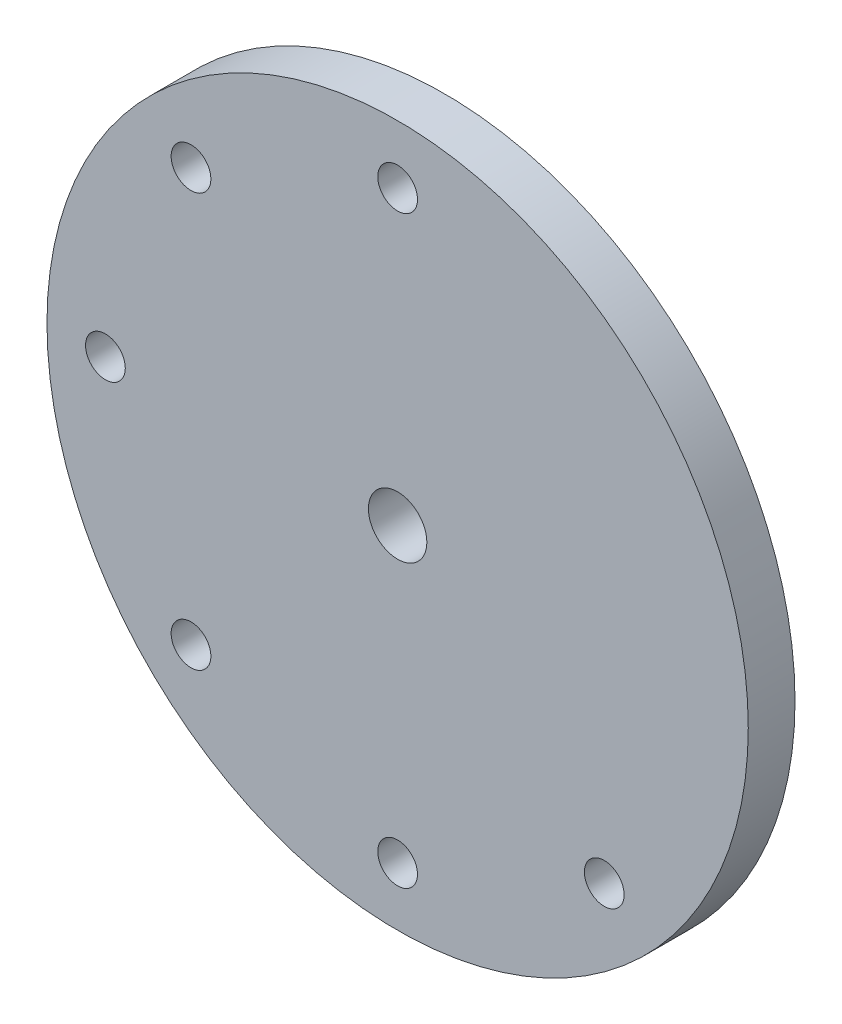
ISO-10303-21;
HEADER;
FILE_DESCRIPTION(('STEP AP214'),'2;1');
FILE_NAME('part.step','',(''),(''),'','','');
FILE_SCHEMA(('AUTOMOTIVE_DESIGN { 1 0 10303 214 1 1 1 1 }'));
ENDSEC;
DATA;
#1=APPLICATION_CONTEXT('core data for automotive mechanical design processes');
#2=APPLICATION_PROTOCOL_DEFINITION('international standard','automotive_design',2000,#1);
#3=PRODUCT_CONTEXT('',#1,'mechanical');
#4=PRODUCT('Part','Part','',(#3));
#5=PRODUCT_RELATED_PRODUCT_CATEGORY('part','',(#4));
#6=PRODUCT_DEFINITION_FORMATION('','',#4);
#7=PRODUCT_DEFINITION_CONTEXT('part definition',#1,'design');
#8=PRODUCT_DEFINITION('design','',#6,#7);
#9=PRODUCT_DEFINITION_SHAPE('','',#8);
#10=(LENGTH_UNIT() NAMED_UNIT(*) SI_UNIT(.MILLI.,.METRE.));
#11=(NAMED_UNIT(*) PLANE_ANGLE_UNIT() SI_UNIT($,.RADIAN.));
#12=(NAMED_UNIT(*) SI_UNIT($,.STERADIAN.) SOLID_ANGLE_UNIT());
#13=UNCERTAINTY_MEASURE_WITH_UNIT(LENGTH_MEASURE(1.E-05),#10,'distance_accuracy_value','');
#14=(GEOMETRIC_REPRESENTATION_CONTEXT(3) GLOBAL_UNCERTAINTY_ASSIGNED_CONTEXT((#13)) GLOBAL_UNIT_ASSIGNED_CONTEXT((#10,
#11,#12)) REPRESENTATION_CONTEXT('',''));
#15=CARTESIAN_POINT('',(0.,0.,0.));
#16=DIRECTION('',(0.,0.,1.));
#17=DIRECTION('',(1.,0.,0.));
#18=AXIS2_PLACEMENT_3D('',#15,#16,#17);
#19=CARTESIAN_POINT('',(0.,0.,20.));
#20=DIRECTION('',(0.,0.,1.));
#21=DIRECTION('',(1.,0.,0.));
#22=AXIS2_PLACEMENT_3D('',#19,#20,#21);
#23=PLANE('',#22);
#24=CARTESIAN_POINT('',(88.3883476483187,-88.3883476483183,20.));
#25=DIRECTION('',(0.,0.,1.));
#26=DIRECTION('',(1.,0.,0.));
#27=AXIS2_PLACEMENT_3D('',#24,#25,#26);
#28=CIRCLE('',#27,8.49999999999994);
#29=CARTESIAN_POINT('',(96.8883476483186,-88.3883476483183,20.));
#30=VERTEX_POINT('',#29);
#31=EDGE_CURVE('E78',#30,#30,#28,.T.);
#32=ORIENTED_EDGE('',*,*,#31,.F.);
#33=EDGE_LOOP('',(#32));
#34=FACE_BOUND('',#33,.T.);
#35=CARTESIAN_POINT('',(-88.3883476483187,88.3883476483182,20.));
#36=DIRECTION('',(0.,0.,1.));
#37=DIRECTION('',(1.,0.,0.));
#38=AXIS2_PLACEMENT_3D('',#35,#36,#37);
#39=CIRCLE('',#38,8.50000000000001);
#40=CARTESIAN_POINT('',(-79.8883476483186,88.3883476483182,20.));
#41=VERTEX_POINT('',#40);
#42=EDGE_CURVE('E66',#41,#41,#39,.T.);
#43=ORIENTED_EDGE('',*,*,#42,.F.);
#44=EDGE_LOOP('',(#43));
#45=FACE_BOUND('',#44,.T.);
#46=CARTESIAN_POINT('',(-88.3883476483179,-88.3883476483189,20.));
#47=DIRECTION('',(0.,0.,1.));
#48=DIRECTION('',(1.,0.,0.));
#49=AXIS2_PLACEMENT_3D('',#46,#47,#48);
#50=CIRCLE('',#49,8.50000000000001);
#51=CARTESIAN_POINT('',(-79.8883476483179,-88.3883476483189,20.));
#52=VERTEX_POINT('',#51);
#53=EDGE_CURVE('E54',#52,#52,#50,.T.);
#54=ORIENTED_EDGE('',*,*,#53,.F.);
#55=EDGE_LOOP('',(#54));
#56=FACE_BOUND('',#55,.T.);
#57=CARTESIAN_POINT('',(0.,0.,20.));
#58=DIRECTION('',(0.,0.,1.));
#59=DIRECTION('',(1.,0.,0.));
#60=AXIS2_PLACEMENT_3D('',#57,#58,#59);
#61=CIRCLE('',#60,12.5);
#62=CARTESIAN_POINT('',(12.5,0.,20.));
#63=VERTEX_POINT('',#62);
#64=EDGE_CURVE('E43',#63,#63,#61,.T.);
#65=ORIENTED_EDGE('',*,*,#64,.F.);
#66=EDGE_LOOP('',(#65));
#67=FACE_BOUND('',#66,.T.);
#68=CARTESIAN_POINT('',(0.,0.,20.));
#69=DIRECTION('',(0.,0.,1.));
#70=DIRECTION('',(1.,0.,0.));
#71=AXIS2_PLACEMENT_3D('',#68,#69,#70);
#72=CIRCLE('',#71,150.);
#73=CARTESIAN_POINT('',(150.,0.,20.));
#74=VERTEX_POINT('',#73);
#75=EDGE_CURVE('E10',#74,#74,#72,.T.);
#76=ORIENTED_EDGE('',*,*,#75,.T.);
#77=EDGE_LOOP('',(#76));
#78=FACE_BOUND('',#77,.T.);
#79=CARTESIAN_POINT('',(-125.,-4.9960036108132E-13,20.));
#80=DIRECTION('',(0.,0.,1.));
#81=DIRECTION('',(1.,0.,0.));
#82=AXIS2_PLACEMENT_3D('',#79,#80,#81);
#83=CIRCLE('',#82,8.50000000000005);
#84=CARTESIAN_POINT('',(-116.5,-4.9960036108132E-13,20.));
#85=VERTEX_POINT('',#84);
#86=EDGE_CURVE('E48',#85,#85,#83,.T.);
#87=ORIENTED_EDGE('',*,*,#86,.F.);
#88=EDGE_LOOP('',(#87));
#89=FACE_BOUND('',#88,.T.);
#90=CARTESIAN_POINT('',(0.,-125.,20.));
#91=DIRECTION('',(0.,0.,1.));
#92=DIRECTION('',(1.,0.,0.));
#93=AXIS2_PLACEMENT_3D('',#90,#91,#92);
#94=CIRCLE('',#93,8.5);
#95=CARTESIAN_POINT('',(8.50000000000004,-125.,20.));
#96=VERTEX_POINT('',#95);
#97=EDGE_CURVE('E60',#96,#96,#94,.T.);
#98=ORIENTED_EDGE('',*,*,#97,.F.);
#99=EDGE_LOOP('',(#98));
#100=FACE_BOUND('',#99,.T.);
#101=CARTESIAN_POINT('',(0.,125.,20.));
#102=DIRECTION('',(0.,0.,1.));
#103=DIRECTION('',(1.,0.,0.));
#104=AXIS2_PLACEMENT_3D('',#101,#102,#103);
#105=CIRCLE('',#104,8.5);
#106=CARTESIAN_POINT('',(8.50000000000001,125.,20.));
#107=VERTEX_POINT('',#106);
#108=EDGE_CURVE('E72',#107,#107,#105,.T.);
#109=ORIENTED_EDGE('',*,*,#108,.F.);
#110=EDGE_LOOP('',(#109));
#111=FACE_BOUND('',#110,.T.);
#112=ADVANCED_FACE('F32',(#34,#45,#56,#67,#78,#89,#100,#111),#23,.T.);
#113=CARTESIAN_POINT('',(0.,0.,0.));
#114=DIRECTION('',(0.,0.,1.));
#115=DIRECTION('',(1.,0.,0.));
#116=AXIS2_PLACEMENT_3D('',#113,#114,#115);
#117=PLANE('',#116);
#118=CARTESIAN_POINT('',(0.,0.,0.));
#119=DIRECTION('',(0.,0.,1.));
#120=DIRECTION('',(1.,0.,0.));
#121=AXIS2_PLACEMENT_3D('',#118,#119,#120);
#122=CIRCLE('',#121,150.);
#123=CARTESIAN_POINT('',(150.,0.,0.));
#124=VERTEX_POINT('',#123);
#125=EDGE_CURVE('E36',#124,#124,#122,.T.);
#126=ORIENTED_EDGE('',*,*,#125,.F.);
#127=EDGE_LOOP('',(#126));
#128=FACE_BOUND('',#127,.T.);
#129=CARTESIAN_POINT('',(0.,0.,0.));
#130=DIRECTION('',(0.,0.,1.));
#131=DIRECTION('',(1.,0.,0.));
#132=AXIS2_PLACEMENT_3D('',#129,#130,#131);
#133=CIRCLE('',#132,12.5);
#134=CARTESIAN_POINT('',(12.5,0.,0.));
#135=VERTEX_POINT('',#134);
#136=EDGE_CURVE('E45',#135,#135,#133,.T.);
#137=ORIENTED_EDGE('',*,*,#136,.T.);
#138=EDGE_LOOP('',(#137));
#139=FACE_BOUND('',#138,.T.);
#140=CARTESIAN_POINT('',(-125.,-4.9960036108132E-13,0.));
#141=DIRECTION('',(0.,0.,1.));
#142=DIRECTION('',(1.,0.,0.));
#143=AXIS2_PLACEMENT_3D('',#140,#141,#142);
#144=CIRCLE('',#143,8.50000000000005);
#145=CARTESIAN_POINT('',(-116.5,-4.9960036108132E-13,0.));
#146=VERTEX_POINT('',#145);
#147=EDGE_CURVE('E51',#146,#146,#144,.T.);
#148=ORIENTED_EDGE('',*,*,#147,.T.);
#149=EDGE_LOOP('',(#148));
#150=FACE_BOUND('',#149,.T.);
#151=CARTESIAN_POINT('',(-88.3883476483179,-88.3883476483189,0.));
#152=DIRECTION('',(0.,0.,1.));
#153=DIRECTION('',(1.,0.,0.));
#154=AXIS2_PLACEMENT_3D('',#151,#152,#153);
#155=CIRCLE('',#154,8.50000000000001);
#156=CARTESIAN_POINT('',(-79.8883476483179,-88.3883476483189,0.));
#157=VERTEX_POINT('',#156);
#158=EDGE_CURVE('E57',#157,#157,#155,.T.);
#159=ORIENTED_EDGE('',*,*,#158,.T.);
#160=EDGE_LOOP('',(#159));
#161=FACE_BOUND('',#160,.T.);
#162=CARTESIAN_POINT('',(0.,-125.,0.));
#163=DIRECTION('',(0.,0.,1.));
#164=DIRECTION('',(1.,0.,0.));
#165=AXIS2_PLACEMENT_3D('',#162,#163,#164);
#166=CIRCLE('',#165,8.5);
#167=CARTESIAN_POINT('',(8.50000000000004,-125.,0.));
#168=VERTEX_POINT('',#167);
#169=EDGE_CURVE('E63',#168,#168,#166,.T.);
#170=ORIENTED_EDGE('',*,*,#169,.T.);
#171=EDGE_LOOP('',(#170));
#172=FACE_BOUND('',#171,.T.);
#173=CARTESIAN_POINT('',(-88.3883476483187,88.3883476483182,0.));
#174=DIRECTION('',(0.,0.,1.));
#175=DIRECTION('',(1.,0.,0.));
#176=AXIS2_PLACEMENT_3D('',#173,#174,#175);
#177=CIRCLE('',#176,8.50000000000001);
#178=CARTESIAN_POINT('',(-79.8883476483186,88.3883476483182,0.));
#179=VERTEX_POINT('',#178);
#180=EDGE_CURVE('E69',#179,#179,#177,.T.);
#181=ORIENTED_EDGE('',*,*,#180,.T.);
#182=EDGE_LOOP('',(#181));
#183=FACE_BOUND('',#182,.T.);
#184=CARTESIAN_POINT('',(0.,125.,0.));
#185=DIRECTION('',(0.,0.,1.));
#186=DIRECTION('',(1.,0.,0.));
#187=AXIS2_PLACEMENT_3D('',#184,#185,#186);
#188=CIRCLE('',#187,8.5);
#189=CARTESIAN_POINT('',(8.50000000000001,125.,0.));
#190=VERTEX_POINT('',#189);
#191=EDGE_CURVE('E75',#190,#190,#188,.T.);
#192=ORIENTED_EDGE('',*,*,#191,.T.);
#193=EDGE_LOOP('',(#192));
#194=FACE_BOUND('',#193,.T.);
#195=CARTESIAN_POINT('',(88.3883476483187,-88.3883476483183,0.));
#196=DIRECTION('',(0.,0.,1.));
#197=DIRECTION('',(1.,0.,0.));
#198=AXIS2_PLACEMENT_3D('',#195,#196,#197);
#199=CIRCLE('',#198,8.49999999999994);
#200=CARTESIAN_POINT('',(96.8883476483186,-88.3883476483183,0.));
#201=VERTEX_POINT('',#200);
#202=EDGE_CURVE('E81',#201,#201,#199,.T.);
#203=ORIENTED_EDGE('',*,*,#202,.T.);
#204=EDGE_LOOP('',(#203));
#205=FACE_BOUND('',#204,.T.);
#206=ADVANCED_FACE('F92',(#128,#139,#150,#161,#172,#183,#194,#205),#117,.F.);
#207=CARTESIAN_POINT('',(0.,0.,20.));
#208=DIRECTION('',(0.,0.,-1.));
#209=DIRECTION('',(-1.,0.,0.));
#210=AXIS2_PLACEMENT_3D('',#207,#208,#209);
#211=CYLINDRICAL_SURFACE('',#210,150.);
#212=ORIENTED_EDGE('',*,*,#75,.F.);
#213=EDGE_LOOP('',(#212));
#214=FACE_BOUND('',#213,.T.);
#215=ORIENTED_EDGE('',*,*,#125,.T.);
#216=EDGE_LOOP('',(#215));
#217=FACE_BOUND('',#216,.T.);
#218=ADVANCED_FACE('F34',(#214,#217),#211,.T.);
#219=CARTESIAN_POINT('',(0.,0.,20.));
#220=DIRECTION('',(0.,0.,-1.));
#221=DIRECTION('',(-1.,0.,0.));
#222=AXIS2_PLACEMENT_3D('',#219,#220,#221);
#223=CYLINDRICAL_SURFACE('',#222,12.5);
#224=ORIENTED_EDGE('',*,*,#64,.T.);
#225=EDGE_LOOP('',(#224));
#226=FACE_BOUND('',#225,.T.);
#227=ORIENTED_EDGE('',*,*,#136,.F.);
#228=EDGE_LOOP('',(#227));
#229=FACE_BOUND('',#228,.T.);
#230=ADVANCED_FACE('F136',(#226,#229),#223,.F.);
#231=CARTESIAN_POINT('',(-125.,-4.9960036108132E-13,20.));
#232=DIRECTION('',(0.,0.,-1.));
#233=DIRECTION('',(-1.,0.,0.));
#234=AXIS2_PLACEMENT_3D('',#231,#232,#233);
#235=CYLINDRICAL_SURFACE('',#234,8.50000000000005);
#236=ORIENTED_EDGE('',*,*,#86,.T.);
#237=EDGE_LOOP('',(#236));
#238=FACE_BOUND('',#237,.T.);
#239=ORIENTED_EDGE('',*,*,#147,.F.);
#240=EDGE_LOOP('',(#239));
#241=FACE_BOUND('',#240,.T.);
#242=ADVANCED_FACE('F132',(#238,#241),#235,.F.);
#243=CARTESIAN_POINT('',(-88.3883476483179,-88.3883476483189,20.));
#244=DIRECTION('',(0.,0.,-1.));
#245=DIRECTION('',(-1.,0.,0.));
#246=AXIS2_PLACEMENT_3D('',#243,#244,#245);
#247=CYLINDRICAL_SURFACE('',#246,8.50000000000001);
#248=ORIENTED_EDGE('',*,*,#53,.T.);
#249=EDGE_LOOP('',(#248));
#250=FACE_BOUND('',#249,.T.);
#251=ORIENTED_EDGE('',*,*,#158,.F.);
#252=EDGE_LOOP('',(#251));
#253=FACE_BOUND('',#252,.T.);
#254=ADVANCED_FACE('F128',(#250,#253),#247,.F.);
#255=CARTESIAN_POINT('',(0.,-125.,20.));
#256=DIRECTION('',(0.,0.,-1.));
#257=DIRECTION('',(-1.,0.,0.));
#258=AXIS2_PLACEMENT_3D('',#255,#256,#257);
#259=CYLINDRICAL_SURFACE('',#258,8.5);
#260=ORIENTED_EDGE('',*,*,#97,.T.);
#261=EDGE_LOOP('',(#260));
#262=FACE_BOUND('',#261,.T.);
#263=ORIENTED_EDGE('',*,*,#169,.F.);
#264=EDGE_LOOP('',(#263));
#265=FACE_BOUND('',#264,.T.);
#266=ADVANCED_FACE('F124',(#262,#265),#259,.F.);
#267=CARTESIAN_POINT('',(-88.3883476483187,88.3883476483182,20.));
#268=DIRECTION('',(0.,0.,-1.));
#269=DIRECTION('',(-1.,0.,0.));
#270=AXIS2_PLACEMENT_3D('',#267,#268,#269);
#271=CYLINDRICAL_SURFACE('',#270,8.50000000000001);
#272=ORIENTED_EDGE('',*,*,#42,.T.);
#273=EDGE_LOOP('',(#272));
#274=FACE_BOUND('',#273,.T.);
#275=ORIENTED_EDGE('',*,*,#180,.F.);
#276=EDGE_LOOP('',(#275));
#277=FACE_BOUND('',#276,.T.);
#278=ADVANCED_FACE('F109',(#274,#277),#271,.F.);
#279=CARTESIAN_POINT('',(0.,125.,20.));
#280=DIRECTION('',(0.,0.,-1.));
#281=DIRECTION('',(-1.,0.,0.));
#282=AXIS2_PLACEMENT_3D('',#279,#280,#281);
#283=CYLINDRICAL_SURFACE('',#282,8.5);
#284=ORIENTED_EDGE('',*,*,#108,.T.);
#285=EDGE_LOOP('',(#284));
#286=FACE_BOUND('',#285,.T.);
#287=ORIENTED_EDGE('',*,*,#191,.F.);
#288=EDGE_LOOP('',(#287));
#289=FACE_BOUND('',#288,.T.);
#290=ADVANCED_FACE('F106',(#286,#289),#283,.F.);
#291=CARTESIAN_POINT('',(88.3883476483187,-88.3883476483183,20.));
#292=DIRECTION('',(0.,0.,-1.));
#293=DIRECTION('',(-1.,0.,0.));
#294=AXIS2_PLACEMENT_3D('',#291,#292,#293);
#295=CYLINDRICAL_SURFACE('',#294,8.49999999999994);
#296=ORIENTED_EDGE('',*,*,#31,.T.);
#297=EDGE_LOOP('',(#296));
#298=FACE_BOUND('',#297,.T.);
#299=ORIENTED_EDGE('',*,*,#202,.F.);
#300=EDGE_LOOP('',(#299));
#301=FACE_BOUND('',#300,.T.);
#302=ADVANCED_FACE('F87',(#298,#301),#295,.F.);
#303=CLOSED_SHELL('',(#112,#206,#218,#230,#242,#254,#266,#278,#290,#302));
#304=MANIFOLD_SOLID_BREP('B2',#303);
#305=ADVANCED_BREP_SHAPE_REPRESENTATION('',(#18,#304),#14);
#306=SHAPE_DEFINITION_REPRESENTATION(#9,#305);
ENDSEC;
END-ISO-10303-21;
